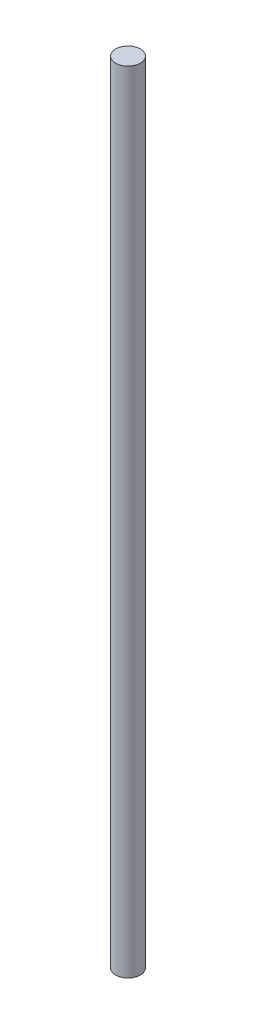
ISO-10303-21;
HEADER;
FILE_DESCRIPTION(('STEP AP214'),'2;1');
FILE_NAME('part.step','',(''),(''),'','','');
FILE_SCHEMA(('AUTOMOTIVE_DESIGN { 1 0 10303 214 1 1 1 1 }'));
ENDSEC;
DATA;
#1=APPLICATION_CONTEXT('core data for automotive mechanical design processes');
#2=APPLICATION_PROTOCOL_DEFINITION('international standard','automotive_design',2000,#1);
#3=PRODUCT_CONTEXT('',#1,'mechanical');
#4=PRODUCT('Part','Part','',(#3));
#5=PRODUCT_RELATED_PRODUCT_CATEGORY('part','',(#4));
#6=PRODUCT_DEFINITION_FORMATION('','',#4);
#7=PRODUCT_DEFINITION_CONTEXT('part definition',#1,'design');
#8=PRODUCT_DEFINITION('design','',#6,#7);
#9=PRODUCT_DEFINITION_SHAPE('','',#8);
#10=(LENGTH_UNIT() NAMED_UNIT(*) SI_UNIT(.MILLI.,.METRE.));
#11=(NAMED_UNIT(*) PLANE_ANGLE_UNIT() SI_UNIT($,.RADIAN.));
#12=(NAMED_UNIT(*) SI_UNIT($,.STERADIAN.) SOLID_ANGLE_UNIT());
#13=UNCERTAINTY_MEASURE_WITH_UNIT(LENGTH_MEASURE(1.E-05),#10,'distance_accuracy_value','');
#14=(GEOMETRIC_REPRESENTATION_CONTEXT(3) GLOBAL_UNCERTAINTY_ASSIGNED_CONTEXT((#13)) GLOBAL_UNIT_ASSIGNED_CONTEXT((#10,
#11,#12)) REPRESENTATION_CONTEXT('',''));
#15=CARTESIAN_POINT('',(0.,0.,0.));
#16=DIRECTION('',(0.,0.,1.));
#17=DIRECTION('',(1.,0.,0.));
#18=AXIS2_PLACEMENT_3D('',#15,#16,#17);
#19=CARTESIAN_POINT('',(0.,203.2,0.));
#20=DIRECTION('',(0.,-1.,0.));
#21=DIRECTION('',(0.,0.,-1.));
#22=AXIS2_PLACEMENT_3D('',#19,#20,#21);
#23=CYLINDRICAL_SURFACE('',#22,3.175);
#24=CARTESIAN_POINT('',(0.,203.2,0.));
#25=DIRECTION('',(0.,1.,0.));
#26=DIRECTION('',(0.,0.,1.));
#27=AXIS2_PLACEMENT_3D('',#24,#25,#26);
#28=CIRCLE('',#27,3.175);
#29=CARTESIAN_POINT('',(0.,203.2,3.175));
#30=VERTEX_POINT('',#29);
#31=EDGE_CURVE('E10',#30,#30,#28,.T.);
#32=ORIENTED_EDGE('',*,*,#31,.F.);
#33=EDGE_LOOP('',(#32));
#34=FACE_BOUND('',#33,.T.);
#35=CARTESIAN_POINT('',(0.,0.,0.));
#36=DIRECTION('',(0.,1.,0.));
#37=DIRECTION('',(0.,0.,1.));
#38=AXIS2_PLACEMENT_3D('',#35,#36,#37);
#39=CIRCLE('',#38,3.175);
#40=CARTESIAN_POINT('',(0.,0.,3.175));
#41=VERTEX_POINT('',#40);
#42=EDGE_CURVE('E34',#41,#41,#39,.T.);
#43=ORIENTED_EDGE('',*,*,#42,.T.);
#44=EDGE_LOOP('',(#43));
#45=FACE_BOUND('',#44,.T.);
#46=ADVANCED_FACE('F31',(#34,#45),#23,.T.);
#47=CARTESIAN_POINT('',(0.,203.2,0.));
#48=DIRECTION('',(0.,1.,0.));
#49=DIRECTION('',(0.,0.,1.));
#50=AXIS2_PLACEMENT_3D('',#47,#48,#49);
#51=PLANE('',#50);
#52=ORIENTED_EDGE('',*,*,#31,.T.);
#53=EDGE_LOOP('',(#52));
#54=FACE_BOUND('',#53,.T.);
#55=ADVANCED_FACE('F46',(#54),#51,.T.);
#56=CARTESIAN_POINT('',(0.,0.,0.));
#57=DIRECTION('',(0.,1.,0.));
#58=DIRECTION('',(0.,0.,1.));
#59=AXIS2_PLACEMENT_3D('',#56,#57,#58);
#60=PLANE('',#59);
#61=ORIENTED_EDGE('',*,*,#42,.F.);
#62=EDGE_LOOP('',(#61));
#63=FACE_BOUND('',#62,.T.);
#64=ADVANCED_FACE('F44',(#63),#60,.F.);
#65=CLOSED_SHELL('',(#46,#55,#64));
#66=MANIFOLD_SOLID_BREP('B2',#65);
#67=ADVANCED_BREP_SHAPE_REPRESENTATION('',(#18,#66),#14);
#68=SHAPE_DEFINITION_REPRESENTATION(#9,#67);
ENDSEC;
END-ISO-10303-21;
